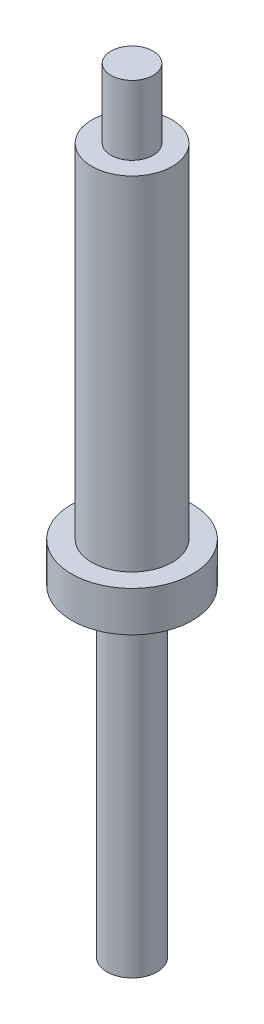
ISO-10303-21;
HEADER;
FILE_DESCRIPTION(('STEP AP214'),'2;1');
FILE_NAME('part.step','',(''),(''),'','','');
FILE_SCHEMA(('AUTOMOTIVE_DESIGN { 1 0 10303 214 1 1 1 1 }'));
ENDSEC;
DATA;
#1=APPLICATION_CONTEXT('core data for automotive mechanical design processes');
#2=APPLICATION_PROTOCOL_DEFINITION('international standard','automotive_design',2000,#1);
#3=PRODUCT_CONTEXT('',#1,'mechanical');
#4=PRODUCT('Part','Part','',(#3));
#5=PRODUCT_RELATED_PRODUCT_CATEGORY('part','',(#4));
#6=PRODUCT_DEFINITION_FORMATION('','',#4);
#7=PRODUCT_DEFINITION_CONTEXT('part definition',#1,'design');
#8=PRODUCT_DEFINITION('design','',#6,#7);
#9=PRODUCT_DEFINITION_SHAPE('','',#8);
#10=(LENGTH_UNIT() NAMED_UNIT(*) SI_UNIT(.MILLI.,.METRE.));
#11=(NAMED_UNIT(*) PLANE_ANGLE_UNIT() SI_UNIT($,.RADIAN.));
#12=(NAMED_UNIT(*) SI_UNIT($,.STERADIAN.) SOLID_ANGLE_UNIT());
#13=UNCERTAINTY_MEASURE_WITH_UNIT(LENGTH_MEASURE(1.E-05),#10,'distance_accuracy_value','');
#14=(GEOMETRIC_REPRESENTATION_CONTEXT(3) GLOBAL_UNCERTAINTY_ASSIGNED_CONTEXT((#13)) GLOBAL_UNIT_ASSIGNED_CONTEXT((#10,
#11,#12)) REPRESENTATION_CONTEXT('',''));
#15=CARTESIAN_POINT('',(0.,0.,0.));
#16=DIRECTION('',(0.,0.,1.));
#17=DIRECTION('',(1.,0.,0.));
#18=AXIS2_PLACEMENT_3D('',#15,#16,#17);
#19=CARTESIAN_POINT('',(0.,0.,0.));
#20=DIRECTION('',(0.,-1.,0.));
#21=DIRECTION('',(0.,0.,-1.));
#22=AXIS2_PLACEMENT_3D('',#19,#20,#21);
#23=CYLINDRICAL_SURFACE('',#22,3.175);
#24=CARTESIAN_POINT('',(0.,55.626,0.));
#25=DIRECTION('',(0.,-1.,0.));
#26=DIRECTION('',(0.,0.,-1.));
#27=AXIS2_PLACEMENT_3D('',#24,#25,#26);
#28=CIRCLE('',#27,3.175);
#29=CARTESIAN_POINT('',(0.,55.626,-3.175));
#30=VERTEX_POINT('',#29);
#31=EDGE_CURVE('E45',#30,#30,#28,.T.);
#32=ORIENTED_EDGE('',*,*,#31,.T.);
#33=EDGE_LOOP('',(#32));
#34=FACE_BOUND('',#33,.T.);
#35=CARTESIAN_POINT('',(0.,28.575,0.));
#36=DIRECTION('',(0.,-1.,0.));
#37=DIRECTION('',(0.,0.,-1.));
#38=AXIS2_PLACEMENT_3D('',#35,#36,#37);
#39=CIRCLE('',#38,3.175);
#40=CARTESIAN_POINT('',(0.,28.575,-3.175));
#41=VERTEX_POINT('',#40);
#42=EDGE_CURVE('E37',#41,#41,#39,.F.);
#43=ORIENTED_EDGE('',*,*,#42,.T.);
#44=EDGE_LOOP('',(#43));
#45=FACE_BOUND('',#44,.T.);
#46=ADVANCED_FACE('F33',(#34,#45),#23,.T.);
#47=CARTESIAN_POINT('',(3.175,55.626,0.));
#48=DIRECTION('',(0.,1.,0.));
#49=DIRECTION('',(0.,0.,1.));
#50=AXIS2_PLACEMENT_3D('',#47,#48,#49);
#51=PLANE('',#50);
#52=CARTESIAN_POINT('',(0.,55.626,0.));
#53=DIRECTION('',(0.,-1.,0.));
#54=DIRECTION('',(0.,0.,-1.));
#55=AXIS2_PLACEMENT_3D('',#52,#53,#54);
#56=CIRCLE('',#55,1.6637);
#57=CARTESIAN_POINT('',(0.,55.626,-1.6637));
#58=VERTEX_POINT('',#57);
#59=EDGE_CURVE('E50',#58,#58,#56,.T.);
#60=ORIENTED_EDGE('',*,*,#59,.T.);
#61=EDGE_LOOP('',(#60));
#62=FACE_BOUND('',#61,.T.);
#63=ORIENTED_EDGE('',*,*,#31,.F.);
#64=EDGE_LOOP('',(#63));
#65=FACE_BOUND('',#64,.T.);
#66=ADVANCED_FACE('F80',(#62,#65),#51,.T.);
#67=CARTESIAN_POINT('',(0.,0.,0.));
#68=DIRECTION('',(0.,-1.,0.));
#69=DIRECTION('',(0.,0.,-1.));
#70=AXIS2_PLACEMENT_3D('',#67,#68,#69);
#71=CYLINDRICAL_SURFACE('',#70,1.6637);
#72=CARTESIAN_POINT('',(0.,61.087,0.));
#73=DIRECTION('',(0.,-1.,0.));
#74=DIRECTION('',(0.,0.,-1.));
#75=AXIS2_PLACEMENT_3D('',#72,#73,#74);
#76=CIRCLE('',#75,1.6637);
#77=CARTESIAN_POINT('',(0.,61.087,-1.6637));
#78=VERTEX_POINT('',#77);
#79=EDGE_CURVE('E53',#78,#78,#76,.T.);
#80=ORIENTED_EDGE('',*,*,#79,.T.);
#81=EDGE_LOOP('',(#80));
#82=FACE_BOUND('',#81,.T.);
#83=ORIENTED_EDGE('',*,*,#59,.F.);
#84=EDGE_LOOP('',(#83));
#85=FACE_BOUND('',#84,.T.);
#86=ADVANCED_FACE('F86',(#82,#85),#71,.T.);
#87=CARTESIAN_POINT('',(1.6637,61.087,0.));
#88=DIRECTION('',(0.,1.,0.));
#89=DIRECTION('',(0.,0.,1.));
#90=AXIS2_PLACEMENT_3D('',#87,#88,#89);
#91=PLANE('',#90);
#92=ORIENTED_EDGE('',*,*,#79,.F.);
#93=EDGE_LOOP('',(#92));
#94=FACE_BOUND('',#93,.T.);
#95=ADVANCED_FACE('F77',(#94),#91,.T.);
#96=CARTESIAN_POINT('',(0.,28.575,0.));
#97=DIRECTION('',(0.,-1.,0.));
#98=DIRECTION('',(0.,0.,-1.));
#99=AXIS2_PLACEMENT_3D('',#96,#97,#98);
#100=CYLINDRICAL_SURFACE('',#99,4.7625);
#101=CARTESIAN_POINT('',(0.,28.575,0.));
#102=DIRECTION('',(0.,-1.,0.));
#103=DIRECTION('',(0.,0.,-1.));
#104=AXIS2_PLACEMENT_3D('',#101,#102,#103);
#105=CIRCLE('',#104,4.7625);
#106=CARTESIAN_POINT('',(0.,28.575,-4.7625));
#107=VERTEX_POINT('',#106);
#108=EDGE_CURVE('E59',#107,#107,#105,.T.);
#109=ORIENTED_EDGE('',*,*,#108,.T.);
#110=EDGE_LOOP('',(#109));
#111=FACE_BOUND('',#110,.T.);
#112=CARTESIAN_POINT('',(0.,25.4,0.));
#113=DIRECTION('',(0.,-1.,0.));
#114=DIRECTION('',(0.,0.,-1.));
#115=AXIS2_PLACEMENT_3D('',#112,#113,#114);
#116=CIRCLE('',#115,4.7625);
#117=CARTESIAN_POINT('',(0.,25.4,-4.7625));
#118=VERTEX_POINT('',#117);
#119=EDGE_CURVE('E56',#118,#118,#116,.T.);
#120=ORIENTED_EDGE('',*,*,#119,.F.);
#121=EDGE_LOOP('',(#120));
#122=FACE_BOUND('',#121,.T.);
#123=ADVANCED_FACE('F70',(#111,#122),#100,.T.);
#124=CARTESIAN_POINT('',(0.,28.575,0.));
#125=DIRECTION('',(0.,-1.,0.));
#126=DIRECTION('',(0.,0.,-1.));
#127=AXIS2_PLACEMENT_3D('',#124,#125,#126);
#128=PLANE('',#127);
#129=ORIENTED_EDGE('',*,*,#42,.F.);
#130=EDGE_LOOP('',(#129));
#131=FACE_BOUND('',#130,.T.);
#132=ORIENTED_EDGE('',*,*,#108,.F.);
#133=EDGE_LOOP('',(#132));
#134=FACE_BOUND('',#133,.T.);
#135=ADVANCED_FACE('F67',(#131,#134),#128,.F.);
#136=CARTESIAN_POINT('',(0.,0.,0.));
#137=DIRECTION('',(0.,-1.,0.));
#138=DIRECTION('',(0.,0.,-1.));
#139=AXIS2_PLACEMENT_3D('',#136,#137,#138);
#140=PLANE('',#139);
#141=CARTESIAN_POINT('',(0.,0.,0.));
#142=DIRECTION('',(0.,-1.,0.));
#143=DIRECTION('',(0.,0.,-1.));
#144=AXIS2_PLACEMENT_3D('',#141,#142,#143);
#145=CIRCLE('',#144,1.9812);
#146=CARTESIAN_POINT('',(0.,0.,-1.9812));
#147=VERTEX_POINT('',#146);
#148=EDGE_CURVE('E10',#147,#147,#145,.T.);
#149=ORIENTED_EDGE('',*,*,#148,.T.);
#150=EDGE_LOOP('',(#149));
#151=FACE_BOUND('',#150,.T.);
#152=ADVANCED_FACE('F35',(#151),#140,.T.);
#153=CARTESIAN_POINT('',(0.,0.,0.));
#154=DIRECTION('',(0.,-1.,0.));
#155=DIRECTION('',(0.,0.,-1.));
#156=AXIS2_PLACEMENT_3D('',#153,#154,#155);
#157=CYLINDRICAL_SURFACE('',#156,1.9812);
#158=CARTESIAN_POINT('',(0.,25.4,0.));
#159=DIRECTION('',(0.,-1.,0.));
#160=DIRECTION('',(0.,0.,-1.));
#161=AXIS2_PLACEMENT_3D('',#158,#159,#160);
#162=CIRCLE('',#161,1.9812);
#163=CARTESIAN_POINT('',(0.,25.4,-1.9812));
#164=VERTEX_POINT('',#163);
#165=EDGE_CURVE('E41',#164,#164,#162,.T.);
#166=ORIENTED_EDGE('',*,*,#165,.T.);
#167=EDGE_LOOP('',(#166));
#168=FACE_BOUND('',#167,.T.);
#169=ORIENTED_EDGE('',*,*,#148,.F.);
#170=EDGE_LOOP('',(#169));
#171=FACE_BOUND('',#170,.T.);
#172=ADVANCED_FACE('F76',(#168,#171),#157,.T.);
#173=CARTESIAN_POINT('',(1.9812,25.4,0.));
#174=DIRECTION('',(0.,-1.,0.));
#175=DIRECTION('',(0.,0.,-1.));
#176=AXIS2_PLACEMENT_3D('',#173,#174,#175);
#177=PLANE('',#176);
#178=ORIENTED_EDGE('',*,*,#165,.F.);
#179=EDGE_LOOP('',(#178));
#180=FACE_BOUND('',#179,.T.);
#181=ORIENTED_EDGE('',*,*,#119,.T.);
#182=EDGE_LOOP('',(#181));
#183=FACE_BOUND('',#182,.T.);
#184=ADVANCED_FACE('F91',(#180,#183),#177,.T.);
#185=CLOSED_SHELL('',(#46,#66,#86,#95,#123,#135,#152,#172,#184));
#186=MANIFOLD_SOLID_BREP('B2',#185);
#187=ADVANCED_BREP_SHAPE_REPRESENTATION('',(#18,#186),#14);
#188=SHAPE_DEFINITION_REPRESENTATION(#9,#187);
ENDSEC;
END-ISO-10303-21;
